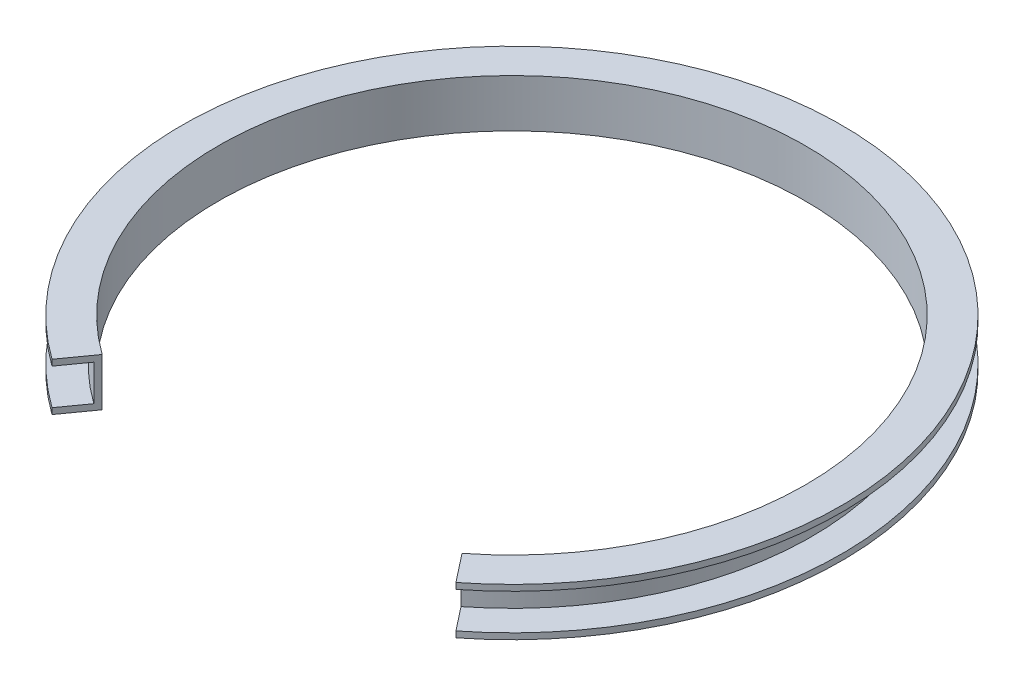
ISO-10303-21;
HEADER;
FILE_DESCRIPTION(('STEP AP214'),'2;1');
FILE_NAME('part.step','',(''),(''),'','','');
FILE_SCHEMA(('AUTOMOTIVE_DESIGN { 1 0 10303 214 1 1 1 1 }'));
ENDSEC;
DATA;
#1=APPLICATION_CONTEXT('core data for automotive mechanical design processes');
#2=APPLICATION_PROTOCOL_DEFINITION('international standard','automotive_design',2000,#1);
#3=PRODUCT_CONTEXT('',#1,'mechanical');
#4=PRODUCT('Part','Part','',(#3));
#5=PRODUCT_RELATED_PRODUCT_CATEGORY('part','',(#4));
#6=PRODUCT_DEFINITION_FORMATION('','',#4);
#7=PRODUCT_DEFINITION_CONTEXT('part definition',#1,'design');
#8=PRODUCT_DEFINITION('design','',#6,#7);
#9=PRODUCT_DEFINITION_SHAPE('','',#8);
#10=(LENGTH_UNIT() NAMED_UNIT(*) SI_UNIT(.MILLI.,.METRE.));
#11=(NAMED_UNIT(*) PLANE_ANGLE_UNIT() SI_UNIT($,.RADIAN.));
#12=(NAMED_UNIT(*) SI_UNIT($,.STERADIAN.) SOLID_ANGLE_UNIT());
#13=UNCERTAINTY_MEASURE_WITH_UNIT(LENGTH_MEASURE(1.E-05),#10,'distance_accuracy_value','');
#14=(GEOMETRIC_REPRESENTATION_CONTEXT(3) GLOBAL_UNCERTAINTY_ASSIGNED_CONTEXT((#13)) GLOBAL_UNIT_ASSIGNED_CONTEXT((#10,
#11,#12)) REPRESENTATION_CONTEXT('',''));
#15=CARTESIAN_POINT('',(0.,0.,0.));
#16=DIRECTION('',(0.,0.,1.));
#17=DIRECTION('',(1.,0.,0.));
#18=AXIS2_PLACEMENT_3D('',#15,#16,#17);
#19=CARTESIAN_POINT('',(105.,6.,0.));
#20=DIRECTION('',(0.,1.,0.));
#21=DIRECTION('',(0.,0.,1.));
#22=AXIS2_PLACEMENT_3D('',#19,#20,#21);
#23=PLANE('',#22);
#24=DIRECTION('',(-0.617035875140749,0.,-0.786935021961337));
#25=VECTOR('',#24,1.);
#26=CARTESIAN_POINT('',(82.6828072688603,6.,105.449292942819));
#27=LINE('',#26,#25);
#28=CARTESIAN_POINT('',(67.8739462654824,6.,86.562852415747));
#29=VERTEX_POINT('',#28);
#30=CARTESIAN_POINT('',(61.7035875140749,6.,78.6935021961337));
#31=VERTEX_POINT('',#30);
#32=EDGE_CURVE('E98',#29,#31,#27,.T.);
#33=ORIENTED_EDGE('',*,*,#32,.T.);
#34=CARTESIAN_POINT('',(0.,6.,0.));
#35=DIRECTION('',(0.,1.,0.));
#36=DIRECTION('',(0.,0.,1.));
#37=AXIS2_PLACEMENT_3D('',#34,#35,#36);
#38=CIRCLE('',#37,100.);
#39=CARTESIAN_POINT('',(-58.2122970157289,6.,81.3100761047028));
#40=VERTEX_POINT('',#39);
#41=EDGE_CURVE('E20',#40,#31,#38,.F.);
#42=ORIENTED_EDGE('',*,*,#41,.F.);
#43=DIRECTION('',(-0.582122970157289,0.,0.813100761047028));
#44=VECTOR('',#43,1.);
#45=CARTESIAN_POINT('',(0.,6.,0.));
#46=LINE('',#45,#44);
#47=CARTESIAN_POINT('',(-64.0335267173018,6.,89.4410837151731));
#48=VERTEX_POINT('',#47);
#49=EDGE_CURVE('E97',#40,#48,#46,.T.);
#50=ORIENTED_EDGE('',*,*,#49,.T.);
#51=CARTESIAN_POINT('',(0.,6.,0.));
#52=DIRECTION('',(0.,1.,0.));
#53=DIRECTION('',(0.,0.,1.));
#54=AXIS2_PLACEMENT_3D('',#51,#52,#53);
#55=CIRCLE('',#54,110.);
#56=EDGE_CURVE('E145',#29,#48,#55,.T.);
#57=ORIENTED_EDGE('',*,*,#56,.F.);
#58=EDGE_LOOP('',(#33,#42,#50,#57));
#59=FACE_BOUND('',#58,.T.);
#60=ADVANCED_FACE('F17',(#59),#23,.F.);
#61=CARTESIAN_POINT('',(0.,0.,0.));
#62=DIRECTION('',(0.,1.,0.));
#63=DIRECTION('',(0.,0.,1.));
#64=AXIS2_PLACEMENT_3D('',#61,#62,#63);
#65=CYLINDRICAL_SURFACE('',#64,100.);
#66=CARTESIAN_POINT('',(0.,-6.,0.));
#67=DIRECTION('',(0.,1.,0.));
#68=DIRECTION('',(0.,0.,1.));
#69=AXIS2_PLACEMENT_3D('',#66,#67,#68);
#70=CIRCLE('',#69,100.);
#71=CARTESIAN_POINT('',(61.7035875140749,-6.,78.6935021961337));
#72=VERTEX_POINT('',#71);
#73=CARTESIAN_POINT('',(-58.2122970157289,-6.,81.3100761047028));
#74=VERTEX_POINT('',#73);
#75=EDGE_CURVE('E104',#72,#74,#70,.T.);
#76=ORIENTED_EDGE('',*,*,#75,.T.);
#77=DIRECTION('',(0.,1.,0.));
#78=VECTOR('',#77,1.);
#79=CARTESIAN_POINT('',(-58.2122970157289,9.60024,81.3100761047028));
#80=LINE('',#79,#78);
#81=EDGE_CURVE('E110',#74,#40,#80,.T.);
#82=ORIENTED_EDGE('',*,*,#81,.T.);
#83=ORIENTED_EDGE('',*,*,#41,.T.);
#84=DIRECTION('',(0.,1.,0.));
#85=VECTOR('',#84,1.);
#86=CARTESIAN_POINT('',(61.7035875140749,9.60024,78.6935021961337));
#87=LINE('',#86,#85);
#88=EDGE_CURVE('E152',#31,#72,#87,.F.);
#89=ORIENTED_EDGE('',*,*,#88,.T.);
#90=EDGE_LOOP('',(#76,#82,#83,#89));
#91=FACE_BOUND('',#90,.T.);
#92=ADVANCED_FACE('F117',(#91),#65,.T.);
#93=CARTESIAN_POINT('',(105.,-6.,0.));
#94=DIRECTION('',(0.,-1.,0.));
#95=DIRECTION('',(0.,0.,-1.));
#96=AXIS2_PLACEMENT_3D('',#93,#94,#95);
#97=PLANE('',#96);
#98=DIRECTION('',(-0.582122970157289,0.,0.813100761047028));
#99=VECTOR('',#98,1.);
#100=CARTESIAN_POINT('',(0.,-6.,0.));
#101=LINE('',#100,#99);
#102=CARTESIAN_POINT('',(-64.0335267173018,-6.,89.4410837151731));
#103=VERTEX_POINT('',#102);
#104=EDGE_CURVE('E119',#103,#74,#101,.F.);
#105=ORIENTED_EDGE('',*,*,#104,.T.);
#106=ORIENTED_EDGE('',*,*,#75,.F.);
#107=DIRECTION('',(-0.617035875140749,0.,-0.786935021961337));
#108=VECTOR('',#107,1.);
#109=CARTESIAN_POINT('',(82.6828072688603,-6.,105.449292942819));
#110=LINE('',#109,#108);
#111=CARTESIAN_POINT('',(67.8739462654824,-6.,86.562852415747));
#112=VERTEX_POINT('',#111);
#113=EDGE_CURVE('E164',#72,#112,#110,.F.);
#114=ORIENTED_EDGE('',*,*,#113,.T.);
#115=CARTESIAN_POINT('',(0.,-6.,0.));
#116=DIRECTION('',(0.,1.,0.));
#117=DIRECTION('',(0.,0.,1.));
#118=AXIS2_PLACEMENT_3D('',#115,#116,#117);
#119=CIRCLE('',#118,110.);
#120=EDGE_CURVE('E142',#103,#112,#119,.F.);
#121=ORIENTED_EDGE('',*,*,#120,.F.);
#122=EDGE_LOOP('',(#105,#106,#114,#121));
#123=FACE_BOUND('',#122,.T.);
#124=ADVANCED_FACE('F185',(#123),#97,.F.);
#125=CARTESIAN_POINT('',(0.,7.,0.));
#126=DIRECTION('',(0.,1.,0.));
#127=DIRECTION('',(0.,0.,1.));
#128=AXIS2_PLACEMENT_3D('',#125,#126,#127);
#129=CYLINDRICAL_SURFACE('',#128,110.);
#130=ORIENTED_EDGE('',*,*,#56,.T.);
#131=DIRECTION('',(0.,1.,0.));
#132=VECTOR('',#131,1.);
#133=CARTESIAN_POINT('',(-64.0335267173018,9.60024,89.4410837151731));
#134=LINE('',#133,#132);
#135=CARTESIAN_POINT('',(-64.0335267173019,8.,89.441083715173));
#136=VERTEX_POINT('',#135);
#137=EDGE_CURVE('E113',#48,#136,#134,.T.);
#138=ORIENTED_EDGE('',*,*,#137,.T.);
#139=CARTESIAN_POINT('',(0.,8.,0.));
#140=DIRECTION('',(0.,1.,0.));
#141=DIRECTION('',(0.,0.,1.));
#142=AXIS2_PLACEMENT_3D('',#139,#140,#141);
#143=CIRCLE('',#142,110.);
#144=CARTESIAN_POINT('',(67.8739462654824,8.,86.562852415747));
#145=VERTEX_POINT('',#144);
#146=EDGE_CURVE('E139',#136,#145,#143,.F.);
#147=ORIENTED_EDGE('',*,*,#146,.T.);
#148=DIRECTION('',(0.,1.,0.));
#149=VECTOR('',#148,1.);
#150=CARTESIAN_POINT('',(67.8739462654824,9.60024,86.5628524157471));
#151=LINE('',#150,#149);
#152=EDGE_CURVE('E153',#145,#29,#151,.F.);
#153=ORIENTED_EDGE('',*,*,#152,.T.);
#154=EDGE_LOOP('',(#130,#138,#147,#153));
#155=FACE_BOUND('',#154,.T.);
#156=ADVANCED_FACE('F201',(#155),#129,.T.);
#157=CARTESIAN_POINT('',(0.,-7.,0.));
#158=DIRECTION('',(0.,1.,0.));
#159=DIRECTION('',(0.,0.,1.));
#160=AXIS2_PLACEMENT_3D('',#157,#158,#159);
#161=CYLINDRICAL_SURFACE('',#160,110.);
#162=CARTESIAN_POINT('',(0.,-8.,0.));
#163=DIRECTION('',(0.,1.,0.));
#164=DIRECTION('',(0.,0.,1.));
#165=AXIS2_PLACEMENT_3D('',#162,#163,#164);
#166=CIRCLE('',#165,110.);
#167=CARTESIAN_POINT('',(67.8739462654824,-8.,86.5628524157471));
#168=VERTEX_POINT('',#167);
#169=CARTESIAN_POINT('',(-64.0335267173019,-8.,89.441083715173));
#170=VERTEX_POINT('',#169);
#171=EDGE_CURVE('E135',#168,#170,#166,.T.);
#172=ORIENTED_EDGE('',*,*,#171,.T.);
#173=DIRECTION('',(0.,1.,0.));
#174=VECTOR('',#173,1.);
#175=CARTESIAN_POINT('',(-64.0335267173018,9.60024,89.4410837151731));
#176=LINE('',#175,#174);
#177=EDGE_CURVE('E125',#170,#103,#176,.T.);
#178=ORIENTED_EDGE('',*,*,#177,.T.);
#179=ORIENTED_EDGE('',*,*,#120,.T.);
#180=DIRECTION('',(0.,1.,0.));
#181=VECTOR('',#180,1.);
#182=CARTESIAN_POINT('',(67.8739462654824,9.60024,86.5628524157471));
#183=LINE('',#182,#181);
#184=EDGE_CURVE('E160',#112,#168,#183,.F.);
#185=ORIENTED_EDGE('',*,*,#184,.T.);
#186=EDGE_LOOP('',(#172,#178,#179,#185));
#187=FACE_BOUND('',#186,.T.);
#188=ADVANCED_FACE('F190',(#187),#161,.T.);
#189=CARTESIAN_POINT('',(0.,9.60024,0.));
#190=DIRECTION('',(-0.813100761047028,0.,-0.582122970157289));
#191=DIRECTION('',(-0.582122970157289,0.,0.813100761047028));
#192=AXIS2_PLACEMENT_3D('',#189,#190,#191);
#193=PLANE('',#192);
#194=ORIENTED_EDGE('',*,*,#81,.F.);
#195=ORIENTED_EDGE('',*,*,#104,.F.);
#196=ORIENTED_EDGE('',*,*,#177,.F.);
#197=DIRECTION('',(0.582122970157297,0.,-0.813100761047022));
#198=VECTOR('',#197,1.);
#199=CARTESIAN_POINT('',(-64.0335267173019,-8.,89.441083715173));
#200=LINE('',#199,#198);
#201=CARTESIAN_POINT('',(-57.0480510754143,-8.,79.6838745826087));
#202=VERTEX_POINT('',#201);
#203=EDGE_CURVE('E156',#170,#202,#200,.T.);
#204=ORIENTED_EDGE('',*,*,#203,.T.);
#205=DIRECTION('',(0.,-1.,0.));
#206=VECTOR('',#205,1.);
#207=CARTESIAN_POINT('',(-57.0480510754143,0.,79.6838745826087));
#208=LINE('',#207,#206);
#209=CARTESIAN_POINT('',(-57.0480510754143,8.,79.6838745826087));
#210=VERTEX_POINT('',#209);
#211=EDGE_CURVE('E134',#202,#210,#208,.F.);
#212=ORIENTED_EDGE('',*,*,#211,.T.);
#213=DIRECTION('',(-0.582122970157297,0.,0.813100761047022));
#214=VECTOR('',#213,1.);
#215=CARTESIAN_POINT('',(-57.0480510754143,8.,79.6838745826087));
#216=LINE('',#215,#214);
#217=EDGE_CURVE('E115',#210,#136,#216,.T.);
#218=ORIENTED_EDGE('',*,*,#217,.T.);
#219=ORIENTED_EDGE('',*,*,#137,.F.);
#220=ORIENTED_EDGE('',*,*,#49,.F.);
#221=EDGE_LOOP('',(#194,#195,#196,#204,#212,#218,#219,#220));
#222=FACE_BOUND('',#221,.T.);
#223=ADVANCED_FACE('F108',(#222),#193,.F.);
#224=CARTESIAN_POINT('',(104.,8.,0.));
#225=DIRECTION('',(0.,-1.,0.));
#226=DIRECTION('',(0.,0.,-1.));
#227=AXIS2_PLACEMENT_3D('',#224,#225,#226);
#228=PLANE('',#227);
#229=ORIENTED_EDGE('',*,*,#217,.F.);
#230=CARTESIAN_POINT('',(0.,8.,0.));
#231=DIRECTION('',(0.,-1.,0.));
#232=DIRECTION('',(0.,0.,-1.));
#233=AXIS2_PLACEMENT_3D('',#230,#231,#232);
#234=CIRCLE('',#233,98.);
#235=CARTESIAN_POINT('',(60.4695157637935,8.,77.119632152211));
#236=VERTEX_POINT('',#235);
#237=EDGE_CURVE('E130',#210,#236,#234,.T.);
#238=ORIENTED_EDGE('',*,*,#237,.T.);
#239=DIRECTION('',(-0.617035875140749,0.,-0.786935021961337));
#240=VECTOR('',#239,1.);
#241=CARTESIAN_POINT('',(82.6828072688603,8.,105.449292942819));
#242=LINE('',#241,#240);
#243=EDGE_CURVE('E157',#236,#145,#242,.F.);
#244=ORIENTED_EDGE('',*,*,#243,.T.);
#245=ORIENTED_EDGE('',*,*,#146,.F.);
#246=EDGE_LOOP('',(#229,#238,#244,#245));
#247=FACE_BOUND('',#246,.T.);
#248=ADVANCED_FACE('F199',(#247),#228,.F.);
#249=CARTESIAN_POINT('',(82.6828072688603,9.60024,105.449292942819));
#250=DIRECTION('',(0.786935021961337,0.,-0.617035875140749));
#251=DIRECTION('',(-0.617035875140749,0.,-0.786935021961337));
#252=AXIS2_PLACEMENT_3D('',#249,#250,#251);
#253=PLANE('',#252);
#254=ORIENTED_EDGE('',*,*,#243,.F.);
#255=DIRECTION('',(0.,-1.,0.));
#256=VECTOR('',#255,1.);
#257=CARTESIAN_POINT('',(60.4695157637935,0.,77.119632152211));
#258=LINE('',#257,#256);
#259=CARTESIAN_POINT('',(60.4695157637935,-8.,77.119632152211));
#260=VERTEX_POINT('',#259);
#261=EDGE_CURVE('E27',#236,#260,#258,.T.);
#262=ORIENTED_EDGE('',*,*,#261,.T.);
#263=DIRECTION('',(0.617035875140742,0.,0.786935021961342));
#264=VECTOR('',#263,1.);
#265=CARTESIAN_POINT('',(60.4695157637935,-8.,77.119632152211));
#266=LINE('',#265,#264);
#267=EDGE_CURVE('E38',#260,#168,#266,.T.);
#268=ORIENTED_EDGE('',*,*,#267,.T.);
#269=ORIENTED_EDGE('',*,*,#184,.F.);
#270=ORIENTED_EDGE('',*,*,#113,.F.);
#271=ORIENTED_EDGE('',*,*,#88,.F.);
#272=ORIENTED_EDGE('',*,*,#32,.F.);
#273=ORIENTED_EDGE('',*,*,#152,.F.);
#274=EDGE_LOOP('',(#254,#262,#268,#269,#270,#271,#272,#273));
#275=FACE_BOUND('',#274,.T.);
#276=ADVANCED_FACE('F188',(#275),#253,.F.);
#277=CARTESIAN_POINT('',(104.,-8.,0.));
#278=DIRECTION('',(0.,1.,0.));
#279=DIRECTION('',(0.,0.,1.));
#280=AXIS2_PLACEMENT_3D('',#277,#278,#279);
#281=PLANE('',#280);
#282=ORIENTED_EDGE('',*,*,#267,.F.);
#283=CARTESIAN_POINT('',(0.,-8.,0.));
#284=DIRECTION('',(0.,-1.,0.));
#285=DIRECTION('',(0.,0.,-1.));
#286=AXIS2_PLACEMENT_3D('',#283,#284,#285);
#287=CIRCLE('',#286,98.);
#288=EDGE_CURVE('E11',#260,#202,#287,.F.);
#289=ORIENTED_EDGE('',*,*,#288,.T.);
#290=ORIENTED_EDGE('',*,*,#203,.F.);
#291=ORIENTED_EDGE('',*,*,#171,.F.);
#292=EDGE_LOOP('',(#282,#289,#290,#291));
#293=FACE_BOUND('',#292,.T.);
#294=ADVANCED_FACE('F191',(#293),#281,.F.);
#295=CARTESIAN_POINT('',(0.,0.,0.));
#296=DIRECTION('',(0.,-1.,0.));
#297=DIRECTION('',(0.,0.,-1.));
#298=AXIS2_PLACEMENT_3D('',#295,#296,#297);
#299=CYLINDRICAL_SURFACE('',#298,98.);
#300=ORIENTED_EDGE('',*,*,#261,.F.);
#301=ORIENTED_EDGE('',*,*,#237,.F.);
#302=ORIENTED_EDGE('',*,*,#211,.F.);
#303=ORIENTED_EDGE('',*,*,#288,.F.);
#304=EDGE_LOOP('',(#300,#301,#302,#303));
#305=FACE_BOUND('',#304,.T.);
#306=ADVANCED_FACE('F194',(#305),#299,.F.);
#307=CLOSED_SHELL('',(#60,#92,#124,#156,#188,#223,#248,#276,#294,#306));
#308=MANIFOLD_SOLID_BREP('B1',#307);
#309=ADVANCED_BREP_SHAPE_REPRESENTATION('',(#18,#308),#14);
#310=SHAPE_DEFINITION_REPRESENTATION(#9,#309);
ENDSEC;
END-ISO-10303-21;
